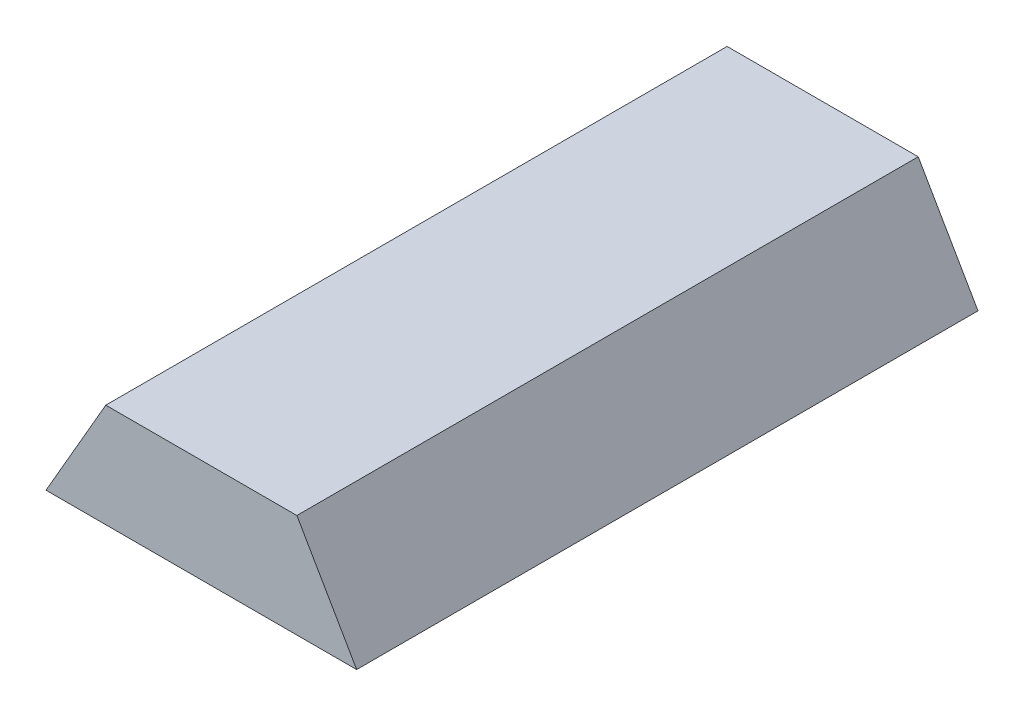
ISO-10303-21;
HEADER;
FILE_DESCRIPTION(('STEP AP214'),'2;1');
FILE_NAME('part.step','',(''),(''),'','','');
FILE_SCHEMA(('AUTOMOTIVE_DESIGN { 1 0 10303 214 1 1 1 1 }'));
ENDSEC;
DATA;
#1=APPLICATION_CONTEXT('core data for automotive mechanical design processes');
#2=APPLICATION_PROTOCOL_DEFINITION('international standard','automotive_design',2000,#1);
#3=PRODUCT_CONTEXT('',#1,'mechanical');
#4=PRODUCT('Part','Part','',(#3));
#5=PRODUCT_RELATED_PRODUCT_CATEGORY('part','',(#4));
#6=PRODUCT_DEFINITION_FORMATION('','',#4);
#7=PRODUCT_DEFINITION_CONTEXT('part definition',#1,'design');
#8=PRODUCT_DEFINITION('design','',#6,#7);
#9=PRODUCT_DEFINITION_SHAPE('','',#8);
#10=(LENGTH_UNIT() NAMED_UNIT(*) SI_UNIT(.MILLI.,.METRE.));
#11=(NAMED_UNIT(*) PLANE_ANGLE_UNIT() SI_UNIT($,.RADIAN.));
#12=(NAMED_UNIT(*) SI_UNIT($,.STERADIAN.) SOLID_ANGLE_UNIT());
#13=UNCERTAINTY_MEASURE_WITH_UNIT(LENGTH_MEASURE(1.E-05),#10,'distance_accuracy_value','');
#14=(GEOMETRIC_REPRESENTATION_CONTEXT(3) GLOBAL_UNCERTAINTY_ASSIGNED_CONTEXT((#13)) GLOBAL_UNIT_ASSIGNED_CONTEXT((#10,
#11,#12)) REPRESENTATION_CONTEXT('',''));
#15=CARTESIAN_POINT('',(0.,0.,0.));
#16=DIRECTION('',(0.,0.,1.));
#17=DIRECTION('',(1.,0.,0.));
#18=AXIS2_PLACEMENT_3D('',#15,#16,#17);
#19=CARTESIAN_POINT('',(0.569957837840645,0.329065311104034,5.));
#20=DIRECTION('',(-0.866025403784439,-0.5,0.));
#21=DIRECTION('',(0.5,-0.866025403784439,0.));
#22=AXIS2_PLACEMENT_3D('',#19,#20,#21);
#23=PLANE('',#22);
#24=DIRECTION('',(-0.5,0.866025403784439,0.));
#25=VECTOR('',#24,1.);
#26=CARTESIAN_POINT('',(0.569957837840645,0.329065311104034,0.));
#27=LINE('',#26,#25);
#28=CARTESIAN_POINT('',(1.25310621649012,-0.85418238982516,0.));
#29=VERTEX_POINT('',#28);
#30=CARTESIAN_POINT('',(0.771980992165432,-0.0208490564918264,0.));
#31=VERTEX_POINT('',#30);
#32=EDGE_CURVE('E99',#29,#31,#27,.T.);
#33=ORIENTED_EDGE('',*,*,#32,.T.);
#34=DIRECTION('',(0.,0.,-1.));
#35=VECTOR('',#34,1.);
#36=CARTESIAN_POINT('',(0.771980992165432,-0.0208490564918264,5.));
#37=LINE('',#36,#35);
#38=CARTESIAN_POINT('',(0.771980992165432,-0.0208490564918264,5.));
#39=VERTEX_POINT('',#38);
#40=EDGE_CURVE('E11',#39,#31,#37,.T.);
#41=ORIENTED_EDGE('',*,*,#40,.F.);
#42=DIRECTION('',(-0.5,0.866025403784439,0.));
#43=VECTOR('',#42,1.);
#44=CARTESIAN_POINT('',(0.569957837840645,0.329065311104034,5.));
#45=LINE('',#44,#43);
#46=CARTESIAN_POINT('',(1.25310621649012,-0.85418238982516,5.));
#47=VERTEX_POINT('',#46);
#48=EDGE_CURVE('E85',#47,#39,#45,.T.);
#49=ORIENTED_EDGE('',*,*,#48,.F.);
#50=DIRECTION('',(0.,0.,-1.));
#51=VECTOR('',#50,1.);
#52=CARTESIAN_POINT('',(1.25310621649012,-0.85418238982516,5.));
#53=LINE('',#52,#51);
#54=EDGE_CURVE('E52',#47,#29,#53,.T.);
#55=ORIENTED_EDGE('',*,*,#54,.T.);
#56=EDGE_LOOP('',(#33,#41,#49,#55));
#57=FACE_BOUND('',#56,.T.);
#58=ADVANCED_FACE('F36',(#57),#23,.F.);
#59=CARTESIAN_POINT('',(0.,-0.0208490564918265,5.));
#60=DIRECTION('',(0.,-1.,0.));
#61=DIRECTION('',(1.,0.,0.));
#62=AXIS2_PLACEMENT_3D('',#59,#60,#61);
#63=PLANE('',#62);
#64=DIRECTION('',(-1.,0.,0.));
#65=VECTOR('',#64,1.);
#66=CARTESIAN_POINT('',(0.,-0.0208490564918265,0.));
#67=LINE('',#66,#65);
#68=CARTESIAN_POINT('',(-0.765768559185191,-0.0208490564918267,0.));
#69=VERTEX_POINT('',#68);
#70=EDGE_CURVE('E90',#31,#69,#67,.T.);
#71=ORIENTED_EDGE('',*,*,#70,.T.);
#72=DIRECTION('',(0.,0.,-1.));
#73=VECTOR('',#72,1.);
#74=CARTESIAN_POINT('',(-0.765768559185191,-0.0208490564918267,5.));
#75=LINE('',#74,#73);
#76=CARTESIAN_POINT('',(-0.765768559185191,-0.0208490564918267,5.));
#77=VERTEX_POINT('',#76);
#78=EDGE_CURVE('E44',#77,#69,#75,.T.);
#79=ORIENTED_EDGE('',*,*,#78,.F.);
#80=DIRECTION('',(-1.,0.,0.));
#81=VECTOR('',#80,1.);
#82=CARTESIAN_POINT('',(0.,-0.0208490564918265,5.));
#83=LINE('',#82,#81);
#84=EDGE_CURVE('E78',#39,#77,#83,.T.);
#85=ORIENTED_EDGE('',*,*,#84,.F.);
#86=ORIENTED_EDGE('',*,*,#40,.T.);
#87=EDGE_LOOP('',(#71,#79,#85,#86));
#88=FACE_BOUND('',#87,.T.);
#89=ADVANCED_FACE('F89',(#88),#63,.F.);
#90=CARTESIAN_POINT('',(-0.565298513105464,0.326375248713935,5.));
#91=DIRECTION('',(0.866025403784439,-0.5,0.));
#92=DIRECTION('',(0.5,0.866025403784439,0.));
#93=AXIS2_PLACEMENT_3D('',#90,#91,#92);
#94=PLANE('',#93);
#95=DIRECTION('',(-0.5,-0.866025403784439,0.));
#96=VECTOR('',#95,1.);
#97=CARTESIAN_POINT('',(-0.565298513105464,0.326375248713935,0.));
#98=LINE('',#97,#96);
#99=CARTESIAN_POINT('',(-1.24689378350988,-0.85418238982516,0.));
#100=VERTEX_POINT('',#99);
#101=EDGE_CURVE('E102',#69,#100,#98,.T.);
#102=ORIENTED_EDGE('',*,*,#101,.T.);
#103=DIRECTION('',(0.,0.,-1.));
#104=VECTOR('',#103,1.);
#105=CARTESIAN_POINT('',(-1.24689378350988,-0.85418238982516,5.));
#106=LINE('',#105,#104);
#107=CARTESIAN_POINT('',(-1.24689378350988,-0.85418238982516,5.));
#108=VERTEX_POINT('',#107);
#109=EDGE_CURVE('E67',#108,#100,#106,.T.);
#110=ORIENTED_EDGE('',*,*,#109,.F.);
#111=DIRECTION('',(-0.5,-0.866025403784439,0.));
#112=VECTOR('',#111,1.);
#113=CARTESIAN_POINT('',(-0.565298513105464,0.326375248713935,5.));
#114=LINE('',#113,#112);
#115=EDGE_CURVE('E84',#77,#108,#114,.T.);
#116=ORIENTED_EDGE('',*,*,#115,.F.);
#117=ORIENTED_EDGE('',*,*,#78,.T.);
#118=EDGE_LOOP('',(#102,#110,#116,#117));
#119=FACE_BOUND('',#118,.T.);
#120=ADVANCED_FACE('F93',(#119),#94,.F.);
#121=CARTESIAN_POINT('',(0.,-0.85418238982516,5.));
#122=DIRECTION('',(0.,-1.,0.));
#123=DIRECTION('',(0.,0.,-1.));
#124=AXIS2_PLACEMENT_3D('',#121,#122,#123);
#125=PLANE('',#124);
#126=DIRECTION('',(-1.,0.,0.));
#127=VECTOR('',#126,1.);
#128=CARTESIAN_POINT('',(0.,-0.85418238982516,0.));
#129=LINE('',#128,#127);
#130=EDGE_CURVE('E104',#29,#100,#129,.T.);
#131=ORIENTED_EDGE('',*,*,#130,.F.);
#132=ORIENTED_EDGE('',*,*,#54,.F.);
#133=DIRECTION('',(-1.,0.,0.));
#134=VECTOR('',#133,1.);
#135=CARTESIAN_POINT('',(0.,-0.85418238982516,5.));
#136=LINE('',#135,#134);
#137=EDGE_CURVE('E94',#47,#108,#136,.T.);
#138=ORIENTED_EDGE('',*,*,#137,.T.);
#139=ORIENTED_EDGE('',*,*,#109,.T.);
#140=EDGE_LOOP('',(#131,#132,#138,#139));
#141=FACE_BOUND('',#140,.T.);
#142=ADVANCED_FACE('F110',(#141),#125,.T.);
#143=CARTESIAN_POINT('',(0.,0.,5.));
#144=DIRECTION('',(0.,0.,1.));
#145=DIRECTION('',(1.,0.,0.));
#146=AXIS2_PLACEMENT_3D('',#143,#144,#145);
#147=PLANE('',#146);
#148=ORIENTED_EDGE('',*,*,#48,.T.);
#149=ORIENTED_EDGE('',*,*,#84,.T.);
#150=ORIENTED_EDGE('',*,*,#115,.T.);
#151=ORIENTED_EDGE('',*,*,#137,.F.);
#152=EDGE_LOOP('',(#148,#149,#150,#151));
#153=FACE_BOUND('',#152,.T.);
#154=ADVANCED_FACE('F81',(#153),#147,.T.);
#155=CARTESIAN_POINT('',(0.,0.,0.));
#156=DIRECTION('',(0.,0.,1.));
#157=DIRECTION('',(1.,0.,0.));
#158=AXIS2_PLACEMENT_3D('',#155,#156,#157);
#159=PLANE('',#158);
#160=ORIENTED_EDGE('',*,*,#32,.F.);
#161=ORIENTED_EDGE('',*,*,#130,.T.);
#162=ORIENTED_EDGE('',*,*,#101,.F.);
#163=ORIENTED_EDGE('',*,*,#70,.F.);
#164=EDGE_LOOP('',(#160,#161,#162,#163));
#165=FACE_BOUND('',#164,.T.);
#166=ADVANCED_FACE('F109',(#165),#159,.F.);
#167=CLOSED_SHELL('',(#58,#89,#120,#142,#154,#166));
#168=MANIFOLD_SOLID_BREP('B2',#167);
#169=ADVANCED_BREP_SHAPE_REPRESENTATION('',(#18,#168),#14);
#170=SHAPE_DEFINITION_REPRESENTATION(#9,#169);
ENDSEC;
END-ISO-10303-21;
